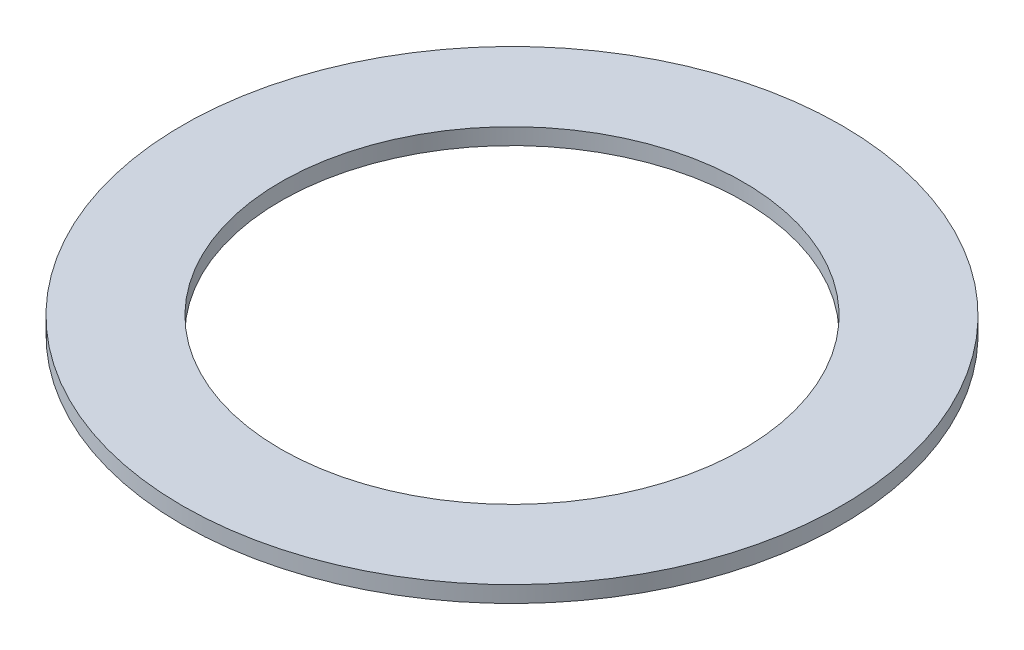
ISO-10303-21;
HEADER;
FILE_DESCRIPTION(('STEP AP214'),'2;1');
FILE_NAME('part.step','',(''),(''),'','','');
FILE_SCHEMA(('AUTOMOTIVE_DESIGN { 1 0 10303 214 1 1 1 1 }'));
ENDSEC;
DATA;
#1=APPLICATION_CONTEXT('core data for automotive mechanical design processes');
#2=APPLICATION_PROTOCOL_DEFINITION('international standard','automotive_design',2000,#1);
#3=PRODUCT_CONTEXT('',#1,'mechanical');
#4=PRODUCT('Part','Part','',(#3));
#5=PRODUCT_RELATED_PRODUCT_CATEGORY('part','',(#4));
#6=PRODUCT_DEFINITION_FORMATION('','',#4);
#7=PRODUCT_DEFINITION_CONTEXT('part definition',#1,'design');
#8=PRODUCT_DEFINITION('design','',#6,#7);
#9=PRODUCT_DEFINITION_SHAPE('','',#8);
#10=(LENGTH_UNIT() NAMED_UNIT(*) SI_UNIT(.MILLI.,.METRE.));
#11=(NAMED_UNIT(*) PLANE_ANGLE_UNIT() SI_UNIT($,.RADIAN.));
#12=(NAMED_UNIT(*) SI_UNIT($,.STERADIAN.) SOLID_ANGLE_UNIT());
#13=UNCERTAINTY_MEASURE_WITH_UNIT(LENGTH_MEASURE(1.E-05),#10,'distance_accuracy_value','');
#14=(GEOMETRIC_REPRESENTATION_CONTEXT(3) GLOBAL_UNCERTAINTY_ASSIGNED_CONTEXT((#13)) GLOBAL_UNIT_ASSIGNED_CONTEXT((#10,
#11,#12)) REPRESENTATION_CONTEXT('',''));
#15=CARTESIAN_POINT('',(0.,0.,0.));
#16=DIRECTION('',(0.,0.,1.));
#17=DIRECTION('',(1.,0.,0.));
#18=AXIS2_PLACEMENT_3D('',#15,#16,#17);
#19=CARTESIAN_POINT('',(0.,5.,0.));
#20=DIRECTION('',(0.,1.,0.));
#21=DIRECTION('',(0.,0.,1.));
#22=AXIS2_PLACEMENT_3D('',#19,#20,#21);
#23=PLANE('',#22);
#24=CARTESIAN_POINT('',(0.,5.,0.));
#25=DIRECTION('',(0.,1.,0.));
#26=DIRECTION('',(0.,0.,1.));
#27=AXIS2_PLACEMENT_3D('',#24,#25,#26);
#28=CIRCLE('',#27,100.625);
#29=CARTESIAN_POINT('',(0.,5.,100.625));
#30=VERTEX_POINT('',#29);
#31=EDGE_CURVE('E10',#30,#30,#28,.T.);
#32=ORIENTED_EDGE('',*,*,#31,.T.);
#33=EDGE_LOOP('',(#32));
#34=FACE_BOUND('',#33,.T.);
#35=CARTESIAN_POINT('',(0.,5.,0.));
#36=DIRECTION('',(0.,1.,0.));
#37=DIRECTION('',(0.,0.,1.));
#38=AXIS2_PLACEMENT_3D('',#35,#36,#37);
#39=CIRCLE('',#38,70.625);
#40=CARTESIAN_POINT('',(0.,5.,70.625));
#41=VERTEX_POINT('',#40);
#42=EDGE_CURVE('E41',#41,#41,#39,.T.);
#43=ORIENTED_EDGE('',*,*,#42,.F.);
#44=EDGE_LOOP('',(#43));
#45=FACE_BOUND('',#44,.T.);
#46=ADVANCED_FACE('F30',(#34,#45),#23,.T.);
#47=CARTESIAN_POINT('',(0.,0.,0.));
#48=DIRECTION('',(0.,1.,0.));
#49=DIRECTION('',(0.,0.,1.));
#50=AXIS2_PLACEMENT_3D('',#47,#48,#49);
#51=PLANE('',#50);
#52=CARTESIAN_POINT('',(0.,0.,0.));
#53=DIRECTION('',(0.,1.,0.));
#54=DIRECTION('',(0.,0.,1.));
#55=AXIS2_PLACEMENT_3D('',#52,#53,#54);
#56=CIRCLE('',#55,100.625);
#57=CARTESIAN_POINT('',(0.,0.,100.625));
#58=VERTEX_POINT('',#57);
#59=EDGE_CURVE('E34',#58,#58,#56,.T.);
#60=ORIENTED_EDGE('',*,*,#59,.F.);
#61=EDGE_LOOP('',(#60));
#62=FACE_BOUND('',#61,.T.);
#63=CARTESIAN_POINT('',(0.,0.,0.));
#64=DIRECTION('',(0.,1.,0.));
#65=DIRECTION('',(0.,0.,1.));
#66=AXIS2_PLACEMENT_3D('',#63,#64,#65);
#67=CIRCLE('',#66,70.625);
#68=CARTESIAN_POINT('',(0.,0.,70.625));
#69=VERTEX_POINT('',#68);
#70=EDGE_CURVE('E43',#69,#69,#67,.T.);
#71=ORIENTED_EDGE('',*,*,#70,.T.);
#72=EDGE_LOOP('',(#71));
#73=FACE_BOUND('',#72,.T.);
#74=ADVANCED_FACE('F53',(#62,#73),#51,.F.);
#75=CARTESIAN_POINT('',(0.,5.,0.));
#76=DIRECTION('',(0.,-1.,0.));
#77=DIRECTION('',(0.,0.,-1.));
#78=AXIS2_PLACEMENT_3D('',#75,#76,#77);
#79=CYLINDRICAL_SURFACE('',#78,100.625);
#80=ORIENTED_EDGE('',*,*,#31,.F.);
#81=EDGE_LOOP('',(#80));
#82=FACE_BOUND('',#81,.T.);
#83=ORIENTED_EDGE('',*,*,#59,.T.);
#84=EDGE_LOOP('',(#83));
#85=FACE_BOUND('',#84,.T.);
#86=ADVANCED_FACE('F32',(#82,#85),#79,.T.);
#87=CARTESIAN_POINT('',(0.,5.,0.));
#88=DIRECTION('',(0.,-1.,0.));
#89=DIRECTION('',(0.,0.,-1.));
#90=AXIS2_PLACEMENT_3D('',#87,#88,#89);
#91=CYLINDRICAL_SURFACE('',#90,70.625);
#92=ORIENTED_EDGE('',*,*,#42,.T.);
#93=EDGE_LOOP('',(#92));
#94=FACE_BOUND('',#93,.T.);
#95=ORIENTED_EDGE('',*,*,#70,.F.);
#96=EDGE_LOOP('',(#95));
#97=FACE_BOUND('',#96,.T.);
#98=ADVANCED_FACE('F49',(#94,#97),#91,.F.);
#99=CLOSED_SHELL('',(#46,#74,#86,#98));
#100=MANIFOLD_SOLID_BREP('B2',#99);
#101=ADVANCED_BREP_SHAPE_REPRESENTATION('',(#18,#100),#14);
#102=SHAPE_DEFINITION_REPRESENTATION(#9,#101);
ENDSEC;
END-ISO-10303-21;
